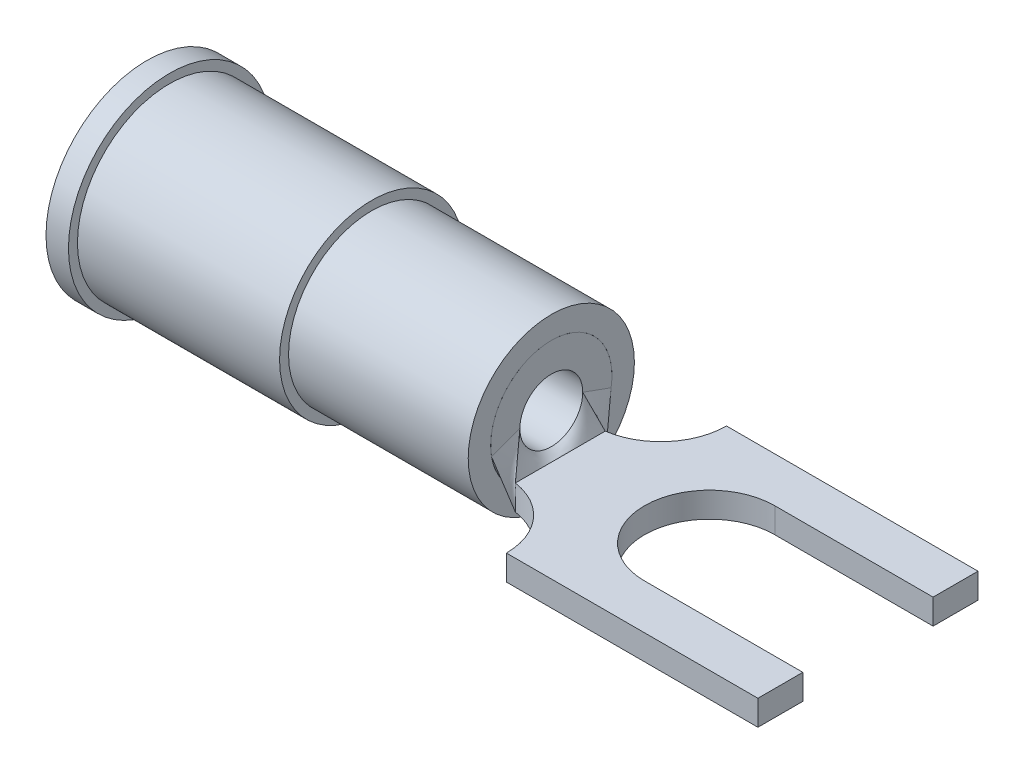
ISO-10303-21;
HEADER;
FILE_DESCRIPTION(('STEP AP214'),'2;1');
FILE_NAME('part.step','',(''),(''),'','','');
FILE_SCHEMA(('AUTOMOTIVE_DESIGN { 1 0 10303 214 1 1 1 1 }'));
ENDSEC;
DATA;
#1=APPLICATION_CONTEXT('core data for automotive mechanical design processes');
#2=APPLICATION_PROTOCOL_DEFINITION('international standard','automotive_design',2000,#1);
#3=PRODUCT_CONTEXT('',#1,'mechanical');
#4=PRODUCT('Part','Part','',(#3));
#5=PRODUCT_RELATED_PRODUCT_CATEGORY('part','',(#4));
#6=PRODUCT_DEFINITION_FORMATION('','',#4);
#7=PRODUCT_DEFINITION_CONTEXT('part definition',#1,'design');
#8=PRODUCT_DEFINITION('design','',#6,#7);
#9=PRODUCT_DEFINITION_SHAPE('','',#8);
#10=(LENGTH_UNIT() NAMED_UNIT(*) SI_UNIT(.MILLI.,.METRE.));
#11=(NAMED_UNIT(*) PLANE_ANGLE_UNIT() SI_UNIT($,.RADIAN.));
#12=(NAMED_UNIT(*) SI_UNIT($,.STERADIAN.) SOLID_ANGLE_UNIT());
#13=UNCERTAINTY_MEASURE_WITH_UNIT(LENGTH_MEASURE(1.E-05),#10,'distance_accuracy_value','');
#14=(GEOMETRIC_REPRESENTATION_CONTEXT(3) GLOBAL_UNCERTAINTY_ASSIGNED_CONTEXT((#13)) GLOBAL_UNIT_ASSIGNED_CONTEXT((#10,
#11,#12)) REPRESENTATION_CONTEXT('',''));
#15=CARTESIAN_POINT('',(0.,0.,0.));
#16=DIRECTION('',(0.,0.,1.));
#17=DIRECTION('',(1.,0.,0.));
#18=AXIS2_PLACEMENT_3D('',#15,#16,#17);
#19=CARTESIAN_POINT('',(11.684,-1.7272,-1.27));
#20=DIRECTION('',(-1.,0.,0.));
#21=DIRECTION('',(0.,0.,1.));
#22=AXIS2_PLACEMENT_3D('',#19,#20,#21);
#23=PLANE('',#22);
#24=DIRECTION('',(0.,0.,1.));
#25=VECTOR('',#24,1.);
#26=CARTESIAN_POINT('',(11.684,-1.016,-1.27));
#27=LINE('',#26,#25);
#28=CARTESIAN_POINT('',(11.684,-1.016,-1.27));
#29=VERTEX_POINT('',#28);
#30=CARTESIAN_POINT('',(11.684,-1.016,1.27));
#31=VERTEX_POINT('',#30);
#32=EDGE_CURVE('E191',#29,#31,#27,.T.);
#33=ORIENTED_EDGE('',*,*,#32,.T.);
#34=DIRECTION('',(0.,1.,0.));
#35=VECTOR('',#34,1.);
#36=CARTESIAN_POINT('',(11.684,-1.7272,1.27));
#37=LINE('',#36,#35);
#38=CARTESIAN_POINT('',(11.684,-1.7272,1.27));
#39=VERTEX_POINT('',#38);
#40=EDGE_CURVE('E100',#39,#31,#37,.T.);
#41=ORIENTED_EDGE('',*,*,#40,.F.);
#42=DIRECTION('',(0.,0.,1.));
#43=VECTOR('',#42,1.);
#44=CARTESIAN_POINT('',(11.684,-1.7272,-1.27));
#45=LINE('',#44,#43);
#46=CARTESIAN_POINT('',(11.684,-1.7272,-1.27));
#47=VERTEX_POINT('',#46);
#48=EDGE_CURVE('E293',#47,#39,#45,.T.);
#49=ORIENTED_EDGE('',*,*,#48,.F.);
#50=DIRECTION('',(0.,1.,0.));
#51=VECTOR('',#50,1.);
#52=CARTESIAN_POINT('',(11.684,-1.7272,-1.27));
#53=LINE('',#52,#51);
#54=EDGE_CURVE('E139',#47,#29,#53,.T.);
#55=ORIENTED_EDGE('',*,*,#54,.T.);
#56=EDGE_LOOP('',(#33,#41,#49,#55));
#57=FACE_BOUND('',#56,.T.);
#58=ADVANCED_FACE('F65',(#57),#23,.F.);
#59=CARTESIAN_POINT('',(11.43,0.,0.));
#60=DIRECTION('',(1.,0.,0.));
#61=DIRECTION('',(0.,0.,-1.));
#62=AXIS2_PLACEMENT_3D('',#59,#60,#61);
#63=PLANE('',#62);
#64=DIRECTION('',(0.,0.34202014332567,-0.939692620785908));
#65=VECTOR('',#64,1.);
#66=CARTESIAN_POINT('',(11.43,0.285719092505667,0.103993245033615));
#67=LINE('',#66,#65);
#68=CARTESIAN_POINT('',(11.43,-0.291379498495464,1.6895585926083));
#69=VERTEX_POINT('',#68);
#70=CARTESIAN_POINT('',(11.43,0.,0.889));
#71=VERTEX_POINT('',#70);
#72=EDGE_CURVE('E133',#69,#71,#67,.T.);
#73=ORIENTED_EDGE('',*,*,#72,.T.);
#74=CARTESIAN_POINT('',(11.43,0.,0.));
#75=DIRECTION('',(1.,0.,0.));
#76=DIRECTION('',(0.,0.,-1.));
#77=AXIS2_PLACEMENT_3D('',#74,#75,#76);
#78=CIRCLE('',#77,0.889);
#79=CARTESIAN_POINT('',(11.43,0.,-0.889));
#80=VERTEX_POINT('',#79);
#81=EDGE_CURVE('E13',#71,#80,#78,.T.);
#82=ORIENTED_EDGE('',*,*,#81,.T.);
#83=DIRECTION('',(0.,-0.34202014332567,-0.939692620785908));
#84=VECTOR('',#83,1.);
#85=CARTESIAN_POINT('',(11.43,0.285719092505667,-0.103993245033615));
#86=LINE('',#85,#84);
#87=CARTESIAN_POINT('',(11.43,-0.291379498495464,-1.6895585926083));
#88=VERTEX_POINT('',#87);
#89=EDGE_CURVE('E76',#80,#88,#86,.T.);
#90=ORIENTED_EDGE('',*,*,#89,.T.);
#91=CARTESIAN_POINT('',(11.43,0.,0.));
#92=DIRECTION('',(1.,0.,0.));
#93=DIRECTION('',(0.,0.,-1.));
#94=AXIS2_PLACEMENT_3D('',#91,#92,#93);
#95=CIRCLE('',#94,1.7145);
#96=EDGE_CURVE('E112',#69,#88,#95,.T.);
#97=ORIENTED_EDGE('',*,*,#96,.F.);
#98=EDGE_LOOP('',(#73,#82,#90,#97));
#99=FACE_BOUND('',#98,.T.);
#100=ADVANCED_FACE('F116',(#99),#63,.F.);
#101=CARTESIAN_POINT('',(11.43,-0.291379498495464,1.6895585926083));
#102=CARTESIAN_POINT('',(11.684,-1.7272,1.27));
#103=CARTESIAN_POINT('',(11.43,-0.430127833182765,1.6656302006868));
#104=CARTESIAN_POINT('',(11.684,-1.7272,1.16416666666667));
#105=CARTESIAN_POINT('',(11.43,-0.581040716903704,1.62218906384854));
#106=CARTESIAN_POINT('',(11.684,-1.7272,1.05833333333333));
#107=CARTESIAN_POINT('',(11.43,-0.891753825247846,1.4744086233896));
#108=CARTESIAN_POINT('',(11.684,-1.7272,0.846666666666665));
#109=CARTESIAN_POINT('',(11.43,-1.05167604388082,1.36940823154506));
#110=CARTESIAN_POINT('',(11.684,-1.7272,0.740833333333331));
#111=CARTESIAN_POINT('',(11.43,-1.3441775724631,1.08373800320161));
#112=CARTESIAN_POINT('',(11.684,-1.7272,0.529166666666664));
#113=CARTESIAN_POINT('',(11.43,-1.47596562928428,0.902303444981081));
#114=CARTESIAN_POINT('',(11.684,-1.7272,0.42333333333333));
#115=CARTESIAN_POINT('',(11.43,-1.66184767881455,0.48050841623427));
#116=CARTESIAN_POINT('',(11.684,-1.7272,0.211666666666663));
#117=CARTESIAN_POINT('',(11.43,-1.7145,0.240688121195688));
#118=CARTESIAN_POINT('',(11.684,-1.7272,0.10583333333333));
#119=CARTESIAN_POINT('',(11.43,-1.7145,-0.240688121195687));
#120=CARTESIAN_POINT('',(11.684,-1.7272,-0.105833333333337));
#121=CARTESIAN_POINT('',(11.43,-1.66184767881455,-0.480508416234269));
#122=CARTESIAN_POINT('',(11.684,-1.7272,-0.21166666666667));
#123=CARTESIAN_POINT('',(11.43,-1.47596562928428,-0.90230344498108));
#124=CARTESIAN_POINT('',(11.684,-1.7272,-0.423333333333336));
#125=CARTESIAN_POINT('',(11.43,-1.3441775724631,-1.08373800320161));
#126=CARTESIAN_POINT('',(11.684,-1.7272,-0.52916666666667));
#127=CARTESIAN_POINT('',(11.43,-1.05167604388082,-1.36940823154506));
#128=CARTESIAN_POINT('',(11.684,-1.7272,-0.740833333333336));
#129=CARTESIAN_POINT('',(11.43,-0.891753825247847,-1.4744086233896));
#130=CARTESIAN_POINT('',(11.684,-1.7272,-0.846666666666669));
#131=CARTESIAN_POINT('',(11.43,-0.581040716903704,-1.62218906384854));
#132=CARTESIAN_POINT('',(11.684,-1.7272,-1.05833333333333));
#133=CARTESIAN_POINT('',(11.43,-0.430127833182766,-1.6656302006868));
#134=CARTESIAN_POINT('',(11.684,-1.7272,-1.16416666666667));
#135=CARTESIAN_POINT('',(11.43,-0.291379498495464,-1.6895585926083));
#136=CARTESIAN_POINT('',(11.684,-1.7272,-1.27));
#137=B_SPLINE_SURFACE_WITH_KNOTS('',3,1,((#101,#102),(#103,#104),(#105,#106),(#107,#108),(#109,
#110),(#111,#112),(#113,#114),(#115,#116),(#117,#118),(#119,#120),(#121,#122),(#123,#124),(#125,
#126),(#127,#128),(#129,#130),(#131,#132),(#133,#134),(#135,#136)),.UNSPECIFIED.,.F.,.F.,.F.,(4,
2,2,2,2,2,2,2,4),(2,2),(0.,0.125,0.25,0.375,0.5,0.625,0.75,0.875,1.),(0.,1.),.UNSPECIFIED.);
#138=DIRECTION('',(0.167405290477298,-0.946314756407977,0.276520976645033));
#139=VECTOR('',#138,1.);
#140=CARTESIAN_POINT('',(11.557,-1.00928974924773,-1.47977929630415));
#141=LINE('',#140,#139);
#142=EDGE_CURVE('E130',#88,#47,#141,.T.);
#143=DIRECTION('',(-0.167405290477298,0.946314756407977,0.276520976645033));
#144=VECTOR('',#143,1.);
#145=CARTESIAN_POINT('',(11.557,-1.00928974924773,1.47977929630415));
#146=LINE('',#145,#144);
#147=EDGE_CURVE('E132',#39,#69,#146,.T.);
#148=ORIENTED_EDGE('',*,*,#96,.T.);
#149=ORIENTED_EDGE('',*,*,#142,.T.);
#150=ORIENTED_EDGE('',*,*,#48,.T.);
#151=ORIENTED_EDGE('',*,*,#147,.T.);
#152=EDGE_LOOP('',(#148,#149,#150,#151));
#153=FACE_BOUND('',#152,.T.);
#154=ADVANCED_FACE('F129',(#153),#137,.T.);
#155=CARTESIAN_POINT('',(11.43,-0.291379498495464,-1.6895585926083));
#156=CARTESIAN_POINT('',(11.684,-1.7272,-1.27));
#157=CARTESIAN_POINT('',(11.43,-0.242816248746221,-1.55613216050692));
#158=CARTESIAN_POINT('',(11.684,-1.60866666666666,-1.27));
#159=CARTESIAN_POINT('',(11.43,-0.194252998996977,-1.42270572840553));
#160=CARTESIAN_POINT('',(11.684,-1.49013333333333,-1.27));
#161=CARTESIAN_POINT('',(11.43,-0.0971264994984887,-1.15585286420277));
#162=CARTESIAN_POINT('',(11.684,-1.25306666666666,-1.27));
#163=CARTESIAN_POINT('',(11.43,-0.0485632497492445,-1.02242643210138));
#164=CARTESIAN_POINT('',(11.684,-1.13453333333333,-1.27));
#165=CARTESIAN_POINT('',(11.43,0.,-0.889));
#166=CARTESIAN_POINT('',(11.684,-1.016,-1.27));
#167=B_SPLINE_SURFACE_WITH_KNOTS('',3,1,((#155,#156),(#157,#158),(#159,#160),(#161,#162),(#163,
#164),(#165,#166)),.UNSPECIFIED.,.F.,.F.,.F.,(4,2,4),(2,2),(0.,0.5,1.),(0.,1.),.UNSPECIFIED.);
#168=DIRECTION('',(0.227921152919277,-0.911684611677103,-0.341881729378914));
#169=VECTOR('',#168,1.);
#170=CARTESIAN_POINT('',(11.557,-0.508,-1.0795));
#171=LINE('',#170,#169);
#172=EDGE_CURVE('E143',#80,#29,#171,.T.);
#173=ORIENTED_EDGE('',*,*,#89,.F.);
#174=ORIENTED_EDGE('',*,*,#172,.T.);
#175=ORIENTED_EDGE('',*,*,#54,.F.);
#176=ORIENTED_EDGE('',*,*,#142,.F.);
#177=EDGE_LOOP('',(#173,#174,#175,#176));
#178=FACE_BOUND('',#177,.T.);
#179=ADVANCED_FACE('F138',(#178),#167,.T.);
#180=CARTESIAN_POINT('',(11.43,0.,0.889));
#181=CARTESIAN_POINT('',(11.684,-1.016,1.27));
#182=CARTESIAN_POINT('',(11.43,-0.0485632497492443,1.02242643210138));
#183=CARTESIAN_POINT('',(11.684,-1.13453333333333,1.27));
#184=CARTESIAN_POINT('',(11.43,-0.0971264994984883,1.15585286420277));
#185=CARTESIAN_POINT('',(11.684,-1.25306666666667,1.27));
#186=CARTESIAN_POINT('',(11.43,-0.194252998996976,1.42270572840553));
#187=CARTESIAN_POINT('',(11.684,-1.49013333333333,1.27));
#188=CARTESIAN_POINT('',(11.43,-0.24281624874622,1.55613216050692));
#189=CARTESIAN_POINT('',(11.684,-1.60866666666667,1.27));
#190=CARTESIAN_POINT('',(11.43,-0.291379498495464,1.6895585926083));
#191=CARTESIAN_POINT('',(11.684,-1.7272,1.27));
#192=B_SPLINE_SURFACE_WITH_KNOTS('',3,1,((#180,#181),(#182,#183),(#184,#185),(#186,#187),(#188,
#189),(#190,#191)),.UNSPECIFIED.,.F.,.F.,.F.,(4,2,4),(2,2),(0.,0.5,1.),(0.,1.),.UNSPECIFIED.);
#193=DIRECTION('',(0.227921152919277,-0.911684611677103,0.341881729378914));
#194=VECTOR('',#193,1.);
#195=CARTESIAN_POINT('',(11.557,-0.508,1.0795));
#196=LINE('',#195,#194);
#197=EDGE_CURVE('E85',#71,#31,#196,.T.);
#198=ORIENTED_EDGE('',*,*,#72,.F.);
#199=ORIENTED_EDGE('',*,*,#147,.F.);
#200=ORIENTED_EDGE('',*,*,#40,.T.);
#201=ORIENTED_EDGE('',*,*,#197,.F.);
#202=EDGE_LOOP('',(#198,#199,#200,#201));
#203=FACE_BOUND('',#202,.T.);
#204=ADVANCED_FACE('F166',(#203),#192,.T.);
#205=CARTESIAN_POINT('',(11.43,0.,-0.889));
#206=CARTESIAN_POINT('',(11.684,-1.016,-1.27));
#207=CARTESIAN_POINT('',(11.43,-0.0740833333333333,-0.889));
#208=CARTESIAN_POINT('',(11.684,-1.016,-1.16416666666667));
#209=CARTESIAN_POINT('',(11.43,-0.1578864,-0.879991466666667));
#210=CARTESIAN_POINT('',(11.684,-1.016,-1.05833333333333));
#211=CARTESIAN_POINT('',(11.43,-0.3399536,-0.826888533333334));
#212=CARTESIAN_POINT('',(11.684,-1.016,-0.846666666666666));
#213=CARTESIAN_POINT('',(11.43,-0.438573333333333,-0.78232));
#214=CARTESIAN_POINT('',(11.684,-1.016,-0.740833333333333));
#215=CARTESIAN_POINT('',(11.43,-0.628226666666667,-0.64008));
#216=CARTESIAN_POINT('',(11.684,-1.016,-0.529166666666666));
#217=CARTESIAN_POINT('',(11.43,-0.718787773933103,-0.541397923875433));
#218=CARTESIAN_POINT('',(11.684,-1.016,-0.423333333333333));
#219=CARTESIAN_POINT('',(11.43,-0.850035755478662,-0.295307958477509));
#220=CARTESIAN_POINT('',(11.684,-1.016,-0.211666666666666));
#221=CARTESIAN_POINT('',(11.43,-0.889,-0.148166666666667));
#222=CARTESIAN_POINT('',(11.684,-1.016,-0.105833333333333));
#223=CARTESIAN_POINT('',(11.43,-0.889,0.148166666666667));
#224=CARTESIAN_POINT('',(11.684,-1.016,0.105833333333334));
#225=CARTESIAN_POINT('',(11.43,-0.850035755478662,0.295307958477509));
#226=CARTESIAN_POINT('',(11.684,-1.016,0.211666666666668));
#227=CARTESIAN_POINT('',(11.43,-0.718787773933103,0.541397923875433));
#228=CARTESIAN_POINT('',(11.684,-1.016,0.423333333333334));
#229=CARTESIAN_POINT('',(11.43,-0.628226666666667,0.64008));
#230=CARTESIAN_POINT('',(11.684,-1.016,0.529166666666667));
#231=CARTESIAN_POINT('',(11.43,-0.438573333333333,0.78232));
#232=CARTESIAN_POINT('',(11.684,-1.016,0.740833333333334));
#233=CARTESIAN_POINT('',(11.43,-0.3399536,0.826888533333334));
#234=CARTESIAN_POINT('',(11.684,-1.016,0.846666666666667));
#235=CARTESIAN_POINT('',(11.43,-0.1578864,0.879991466666667));
#236=CARTESIAN_POINT('',(11.684,-1.016,1.05833333333333));
#237=CARTESIAN_POINT('',(11.43,-0.0740833333333332,0.889));
#238=CARTESIAN_POINT('',(11.684,-1.016,1.16416666666667));
#239=CARTESIAN_POINT('',(11.43,0.,0.889));
#240=CARTESIAN_POINT('',(11.684,-1.016,1.27));
#241=B_SPLINE_SURFACE_WITH_KNOTS('',3,1,((#205,#206),(#207,#208),(#209,#210),(#211,#212),(#213,
#214),(#215,#216),(#217,#218),(#219,#220),(#221,#222),(#223,#224),(#225,#226),(#227,#228),(#229,
#230),(#231,#232),(#233,#234),(#235,#236),(#237,#238),(#239,#240)),.UNSPECIFIED.,.F.,.F.,.F.,(4,
2,2,2,2,2,2,2,4),(2,2),(0.,0.125,0.25,0.375,0.5,0.625,0.75,0.875,1.),(0.,1.),.UNSPECIFIED.);
#242=ORIENTED_EDGE('',*,*,#81,.F.);
#243=ORIENTED_EDGE('',*,*,#197,.T.);
#244=ORIENTED_EDGE('',*,*,#32,.F.);
#245=ORIENTED_EDGE('',*,*,#172,.F.);
#246=EDGE_LOOP('',(#242,#243,#244,#245));
#247=FACE_BOUND('',#246,.T.);
#248=ADVANCED_FACE('F196',(#247),#241,.T.);
#249=CLOSED_SHELL('',(#58,#100,#154,#179,#204,#248));
#250=MANIFOLD_SOLID_BREP('B2',#249);
#251=CARTESIAN_POINT('',(11.43,0.,0.));
#252=DIRECTION('',(1.,0.,0.));
#253=DIRECTION('',(0.,0.,-1.));
#254=AXIS2_PLACEMENT_3D('',#251,#252,#253);
#255=PLANE('',#254);
#256=CARTESIAN_POINT('',(11.43,0.,0.));
#257=DIRECTION('',(1.,0.,0.));
#258=DIRECTION('',(0.,0.,-1.));
#259=AXIS2_PLACEMENT_3D('',#256,#257,#258);
#260=CIRCLE('',#259,1.7145);
#261=CARTESIAN_POINT('',(11.43,-0.291379498495464,-1.6895585926083));
#262=VERTEX_POINT('',#261);
#263=CARTESIAN_POINT('',(11.43,-0.291379498495464,1.6895585926083));
#264=VERTEX_POINT('',#263);
#265=EDGE_CURVE('E447',#262,#264,#260,.T.);
#266=ORIENTED_EDGE('',*,*,#265,.T.);
#267=DIRECTION('',(0.,0.34202014332567,-0.939692620785908));
#268=VECTOR('',#267,1.);
#269=CARTESIAN_POINT('',(11.43,0.285719092505667,0.103993245033615));
#270=LINE('',#269,#268);
#271=CARTESIAN_POINT('',(11.43,0.,0.889));
#272=VERTEX_POINT('',#271);
#273=EDGE_CURVE('E63',#264,#272,#270,.T.);
#274=ORIENTED_EDGE('',*,*,#273,.T.);
#275=CARTESIAN_POINT('',(11.43,0.,0.));
#276=DIRECTION('',(1.,0.,0.));
#277=DIRECTION('',(0.,0.,-1.));
#278=AXIS2_PLACEMENT_3D('',#275,#276,#277);
#279=CIRCLE('',#278,0.889);
#280=CARTESIAN_POINT('',(11.43,0.,-0.889));
#281=VERTEX_POINT('',#280);
#282=EDGE_CURVE('E445',#281,#272,#279,.T.);
#283=ORIENTED_EDGE('',*,*,#282,.F.);
#284=DIRECTION('',(0.,-0.34202014332567,-0.939692620785908));
#285=VECTOR('',#284,1.);
#286=CARTESIAN_POINT('',(11.43,0.285719092505667,-0.103993245033615));
#287=LINE('',#286,#285);
#288=EDGE_CURVE('E419',#281,#262,#287,.T.);
#289=ORIENTED_EDGE('',*,*,#288,.T.);
#290=EDGE_LOOP('',(#266,#274,#283,#289));
#291=FACE_BOUND('',#290,.T.);
#292=ADVANCED_FACE('F410',(#291),#255,.T.);
#293=CARTESIAN_POINT('',(-4.84933830537734,0.,0.));
#294=DIRECTION('',(1.,0.,0.));
#295=DIRECTION('',(0.,0.,-1.));
#296=AXIS2_PLACEMENT_3D('',#293,#294,#295);
#297=CYLINDRICAL_SURFACE('',#296,1.7145);
#298=CARTESIAN_POINT('',(6.35,0.,0.));
#299=DIRECTION('',(1.,0.,0.));
#300=DIRECTION('',(0.,0.,-1.));
#301=AXIS2_PLACEMENT_3D('',#298,#299,#300);
#302=CIRCLE('',#301,1.7145);
#303=CARTESIAN_POINT('',(6.35,0.,-1.7145));
#304=VERTEX_POINT('',#303);
#305=EDGE_CURVE('E442',#304,#304,#302,.F.);
#306=ORIENTED_EDGE('',*,*,#305,.F.);
#307=EDGE_LOOP('',(#306));
#308=FACE_BOUND('',#307,.T.);
#309=EDGE_CURVE('E440',#264,#262,#260,.T.);
#310=ORIENTED_EDGE('',*,*,#309,.F.);
#311=ORIENTED_EDGE('',*,*,#265,.F.);
#312=EDGE_LOOP('',(#310,#311));
#313=FACE_BOUND('',#312,.T.);
#314=ADVANCED_FACE('F412',(#308,#313),#297,.T.);
#315=ORIENTED_EDGE('',*,*,#273,.F.);
#316=ORIENTED_EDGE('',*,*,#309,.T.);
#317=ORIENTED_EDGE('',*,*,#288,.F.);
#318=EDGE_CURVE('E437',#272,#281,#279,.T.);
#319=ORIENTED_EDGE('',*,*,#318,.F.);
#320=EDGE_LOOP('',(#315,#316,#317,#319));
#321=FACE_BOUND('',#320,.T.);
#322=ADVANCED_FACE('F436',(#321),#255,.T.);
#323=CARTESIAN_POINT('',(-4.84933830537734,0.,0.));
#324=DIRECTION('',(1.,0.,0.));
#325=DIRECTION('',(0.,0.,-1.));
#326=AXIS2_PLACEMENT_3D('',#323,#324,#325);
#327=CYLINDRICAL_SURFACE('',#326,0.889);
#328=CARTESIAN_POINT('',(6.35,0.,0.));
#329=DIRECTION('',(1.,0.,0.));
#330=DIRECTION('',(0.,0.,-1.));
#331=AXIS2_PLACEMENT_3D('',#328,#329,#330);
#332=CIRCLE('',#331,0.889);
#333=CARTESIAN_POINT('',(6.35,0.,-0.889));
#334=VERTEX_POINT('',#333);
#335=EDGE_CURVE('E451',#334,#334,#332,.F.);
#336=ORIENTED_EDGE('',*,*,#335,.T.);
#337=EDGE_LOOP('',(#336));
#338=FACE_BOUND('',#337,.T.);
#339=ORIENTED_EDGE('',*,*,#282,.T.);
#340=ORIENTED_EDGE('',*,*,#318,.T.);
#341=EDGE_LOOP('',(#339,#340));
#342=FACE_BOUND('',#341,.T.);
#343=ADVANCED_FACE('F444',(#338,#342),#327,.F.);
#344=CARTESIAN_POINT('',(6.35,2.8575,0.));
#345=DIRECTION('',(1.,0.,0.));
#346=DIRECTION('',(0.,0.,-1.));
#347=AXIS2_PLACEMENT_3D('',#344,#345,#346);
#348=PLANE('',#347);
#349=ORIENTED_EDGE('',*,*,#305,.T.);
#350=EDGE_LOOP('',(#349));
#351=FACE_BOUND('',#350,.T.);
#352=ORIENTED_EDGE('',*,*,#335,.F.);
#353=EDGE_LOOP('',(#352));
#354=FACE_BOUND('',#353,.T.);
#355=ADVANCED_FACE('F458',(#351,#354),#348,.F.);
#356=CLOSED_SHELL('',(#292,#314,#322,#343,#355));
#357=MANIFOLD_SOLID_BREP('B7',#356);
#358=CARTESIAN_POINT('',(11.40968,-1.7272,-3.1115));
#359=DIRECTION('',(0.,1.,0.));
#360=DIRECTION('',(0.,0.,1.));
#361=AXIS2_PLACEMENT_3D('',#358,#359,#360);
#362=CYLINDRICAL_SURFACE('',#361,1.86182);
#363=CARTESIAN_POINT('',(11.40968,-1.016,-3.1115));
#364=DIRECTION('',(0.,-1.,0.));
#365=DIRECTION('',(0.,0.,-1.));
#366=AXIS2_PLACEMENT_3D('',#363,#364,#365);
#367=CIRCLE('',#366,1.86182);
#368=CARTESIAN_POINT('',(13.2715,-1.016,-3.1115));
#369=VERTEX_POINT('',#368);
#370=CARTESIAN_POINT('',(11.684,-1.016,-1.27));
#371=VERTEX_POINT('',#370);
#372=EDGE_CURVE('E628',#369,#371,#367,.T.);
#373=ORIENTED_EDGE('',*,*,#372,.F.);
#374=DIRECTION('',(0.,1.,0.));
#375=VECTOR('',#374,1.);
#376=CARTESIAN_POINT('',(13.2715,-1.7272,-3.1115));
#377=LINE('',#376,#375);
#378=CARTESIAN_POINT('',(13.2715,-1.7272,-3.1115));
#379=VERTEX_POINT('',#378);
#380=EDGE_CURVE('E408',#379,#369,#377,.T.);
#381=ORIENTED_EDGE('',*,*,#380,.F.);
#382=CARTESIAN_POINT('',(11.40968,-1.7272,-3.1115));
#383=DIRECTION('',(0.,-1.,0.));
#384=DIRECTION('',(0.,0.,-1.));
#385=AXIS2_PLACEMENT_3D('',#382,#383,#384);
#386=CIRCLE('',#385,1.86182);
#387=CARTESIAN_POINT('',(11.684,-1.7272,-1.27));
#388=VERTEX_POINT('',#387);
#389=EDGE_CURVE('E654',#379,#388,#386,.T.);
#390=ORIENTED_EDGE('',*,*,#389,.T.);
#391=DIRECTION('',(0.,1.,0.));
#392=VECTOR('',#391,1.);
#393=CARTESIAN_POINT('',(11.684,-1.7272,-1.27));
#394=LINE('',#393,#392);
#395=EDGE_CURVE('E522',#388,#371,#394,.T.);
#396=ORIENTED_EDGE('',*,*,#395,.T.);
#397=EDGE_LOOP('',(#373,#381,#390,#396));
#398=FACE_BOUND('',#397,.T.);
#399=ADVANCED_FACE('F519',(#398),#362,.F.);
#400=CARTESIAN_POINT('',(13.2715,-1.7272,-3.1115));
#401=DIRECTION('',(0.,0.,-1.));
#402=DIRECTION('',(-1.,0.,0.));
#403=AXIS2_PLACEMENT_3D('',#400,#401,#402);
#404=PLANE('',#403);
#405=DIRECTION('',(-1.,0.,0.));
#406=VECTOR('',#405,1.);
#407=CARTESIAN_POINT('',(13.2715,-1.016,-3.1115));
#408=LINE('',#407,#406);
#409=CARTESIAN_POINT('',(20.3835,-1.016,-3.1115));
#410=VERTEX_POINT('',#409);
#411=EDGE_CURVE('E652',#410,#369,#408,.T.);
#412=ORIENTED_EDGE('',*,*,#411,.F.);
#413=DIRECTION('',(0.,1.,0.));
#414=VECTOR('',#413,1.);
#415=CARTESIAN_POINT('',(20.3835,-1.7272,-3.1115));
#416=LINE('',#415,#414);
#417=CARTESIAN_POINT('',(20.3835,-1.7272,-3.1115));
#418=VERTEX_POINT('',#417);
#419=EDGE_CURVE('E528',#418,#410,#416,.T.);
#420=ORIENTED_EDGE('',*,*,#419,.F.);
#421=DIRECTION('',(-1.,0.,0.));
#422=VECTOR('',#421,1.);
#423=CARTESIAN_POINT('',(13.2715,-1.7272,-3.1115));
#424=LINE('',#423,#422);
#425=EDGE_CURVE('E618',#418,#379,#424,.T.);
#426=ORIENTED_EDGE('',*,*,#425,.T.);
#427=ORIENTED_EDGE('',*,*,#380,.T.);
#428=EDGE_LOOP('',(#412,#420,#426,#427));
#429=FACE_BOUND('',#428,.T.);
#430=ADVANCED_FACE('F670',(#429),#404,.T.);
#431=CARTESIAN_POINT('',(20.3835,-1.7272,-3.1115));
#432=DIRECTION('',(1.,0.,0.));
#433=DIRECTION('',(0.,0.,-1.));
#434=AXIS2_PLACEMENT_3D('',#431,#432,#433);
#435=PLANE('',#434);
#436=DIRECTION('',(0.,0.,-1.));
#437=VECTOR('',#436,1.);
#438=CARTESIAN_POINT('',(20.3835,-1.016,-3.1115));
#439=LINE('',#438,#437);
#440=CARTESIAN_POINT('',(20.3835,-1.016,-1.8415));
#441=VERTEX_POINT('',#440);
#442=EDGE_CURVE('E605',#441,#410,#439,.T.);
#443=ORIENTED_EDGE('',*,*,#442,.F.);
#444=DIRECTION('',(0.,1.,0.));
#445=VECTOR('',#444,1.);
#446=CARTESIAN_POINT('',(20.3835,-1.7272,-1.8415));
#447=LINE('',#446,#445);
#448=CARTESIAN_POINT('',(20.3835,-1.7272,-1.8415));
#449=VERTEX_POINT('',#448);
#450=EDGE_CURVE('E600',#449,#441,#447,.T.);
#451=ORIENTED_EDGE('',*,*,#450,.F.);
#452=DIRECTION('',(0.,0.,-1.));
#453=VECTOR('',#452,1.);
#454=CARTESIAN_POINT('',(20.3835,-1.7272,-3.1115));
#455=LINE('',#454,#453);
#456=EDGE_CURVE('E603',#449,#418,#455,.T.);
#457=ORIENTED_EDGE('',*,*,#456,.T.);
#458=ORIENTED_EDGE('',*,*,#419,.T.);
#459=EDGE_LOOP('',(#443,#451,#457,#458));
#460=FACE_BOUND('',#459,.T.);
#461=ADVANCED_FACE('F602',(#460),#435,.T.);
#462=CARTESIAN_POINT('',(20.3835,-1.7272,-1.8415));
#463=DIRECTION('',(0.,0.,1.));
#464=DIRECTION('',(1.,0.,0.));
#465=AXIS2_PLACEMENT_3D('',#462,#463,#464);
#466=PLANE('',#465);
#467=DIRECTION('',(1.,0.,0.));
#468=VECTOR('',#467,1.);
#469=CARTESIAN_POINT('',(20.3835,-1.016,-1.8415));
#470=LINE('',#469,#468);
#471=CARTESIAN_POINT('',(15.90675,-1.016,-1.8415));
#472=VERTEX_POINT('',#471);
#473=EDGE_CURVE('E649',#472,#441,#470,.T.);
#474=ORIENTED_EDGE('',*,*,#473,.F.);
#475=DIRECTION('',(0.,1.,0.));
#476=VECTOR('',#475,1.);
#477=CARTESIAN_POINT('',(15.90675,-1.7272,-1.8415));
#478=LINE('',#477,#476);
#479=CARTESIAN_POINT('',(15.90675,-1.7272,-1.8415));
#480=VERTEX_POINT('',#479);
#481=EDGE_CURVE('E610',#480,#472,#478,.T.);
#482=ORIENTED_EDGE('',*,*,#481,.F.);
#483=DIRECTION('',(1.,0.,0.));
#484=VECTOR('',#483,1.);
#485=CARTESIAN_POINT('',(20.3835,-1.7272,-1.8415));
#486=LINE('',#485,#484);
#487=EDGE_CURVE('E616',#480,#449,#486,.T.);
#488=ORIENTED_EDGE('',*,*,#487,.T.);
#489=ORIENTED_EDGE('',*,*,#450,.T.);
#490=EDGE_LOOP('',(#474,#482,#488,#489));
#491=FACE_BOUND('',#490,.T.);
#492=ADVANCED_FACE('F620',(#491),#466,.T.);
#493=CARTESIAN_POINT('',(15.90675,-1.7272,0.));
#494=DIRECTION('',(0.,1.,0.));
#495=DIRECTION('',(0.,0.,1.));
#496=AXIS2_PLACEMENT_3D('',#493,#494,#495);
#497=CYLINDRICAL_SURFACE('',#496,1.8415);
#498=CARTESIAN_POINT('',(15.90675,-1.016,0.));
#499=DIRECTION('',(0.,-1.,0.));
#500=DIRECTION('',(0.,0.,1.));
#501=AXIS2_PLACEMENT_3D('',#498,#499,#500);
#502=CIRCLE('',#501,1.8415);
#503=CARTESIAN_POINT('',(15.90675,-1.016,1.8415));
#504=VERTEX_POINT('',#503);
#505=EDGE_CURVE('E646',#504,#472,#502,.T.);
#506=ORIENTED_EDGE('',*,*,#505,.F.);
#507=DIRECTION('',(0.,1.,0.));
#508=VECTOR('',#507,1.);
#509=CARTESIAN_POINT('',(15.90675,-1.7272,1.8415));
#510=LINE('',#509,#508);
#511=CARTESIAN_POINT('',(15.90675,-1.7272,1.8415));
#512=VERTEX_POINT('',#511);
#513=EDGE_CURVE('E658',#512,#504,#510,.T.);
#514=ORIENTED_EDGE('',*,*,#513,.F.);
#515=CARTESIAN_POINT('',(15.90675,-1.7272,0.));
#516=DIRECTION('',(0.,-1.,0.));
#517=DIRECTION('',(0.,0.,1.));
#518=AXIS2_PLACEMENT_3D('',#515,#516,#517);
#519=CIRCLE('',#518,1.8415);
#520=EDGE_CURVE('E621',#512,#480,#519,.T.);
#521=ORIENTED_EDGE('',*,*,#520,.T.);
#522=ORIENTED_EDGE('',*,*,#481,.T.);
#523=EDGE_LOOP('',(#506,#514,#521,#522));
#524=FACE_BOUND('',#523,.T.);
#525=ADVANCED_FACE('F683',(#524),#497,.F.);
#526=CARTESIAN_POINT('',(20.3835,-1.7272,1.8415));
#527=DIRECTION('',(0.,0.,-1.));
#528=DIRECTION('',(-1.,0.,0.));
#529=AXIS2_PLACEMENT_3D('',#526,#527,#528);
#530=PLANE('',#529);
#531=DIRECTION('',(-1.,0.,0.));
#532=VECTOR('',#531,1.);
#533=CARTESIAN_POINT('',(20.3835,-1.016,1.8415));
#534=LINE('',#533,#532);
#535=CARTESIAN_POINT('',(20.3835,-1.016,1.8415));
#536=VERTEX_POINT('',#535);
#537=EDGE_CURVE('E643',#536,#504,#534,.T.);
#538=ORIENTED_EDGE('',*,*,#537,.F.);
#539=DIRECTION('',(0.,1.,0.));
#540=VECTOR('',#539,1.);
#541=CARTESIAN_POINT('',(20.3835,-1.7272,1.8415));
#542=LINE('',#541,#540);
#543=CARTESIAN_POINT('',(20.3835,-1.7272,1.8415));
#544=VERTEX_POINT('',#543);
#545=EDGE_CURVE('E660',#544,#536,#542,.T.);
#546=ORIENTED_EDGE('',*,*,#545,.F.);
#547=DIRECTION('',(-1.,0.,0.));
#548=VECTOR('',#547,1.);
#549=CARTESIAN_POINT('',(20.3835,-1.7272,1.8415));
#550=LINE('',#549,#548);
#551=EDGE_CURVE('E623',#544,#512,#550,.T.);
#552=ORIENTED_EDGE('',*,*,#551,.T.);
#553=ORIENTED_EDGE('',*,*,#513,.T.);
#554=EDGE_LOOP('',(#538,#546,#552,#553));
#555=FACE_BOUND('',#554,.T.);
#556=ADVANCED_FACE('F686',(#555),#530,.T.);
#557=CARTESIAN_POINT('',(20.3835,-1.7272,3.1115));
#558=DIRECTION('',(1.,0.,0.));
#559=DIRECTION('',(0.,0.,-1.));
#560=AXIS2_PLACEMENT_3D('',#557,#558,#559);
#561=PLANE('',#560);
#562=DIRECTION('',(0.,0.,-1.));
#563=VECTOR('',#562,1.);
#564=CARTESIAN_POINT('',(20.3835,-1.016,3.1115));
#565=LINE('',#564,#563);
#566=CARTESIAN_POINT('',(20.3835,-1.016,3.1115));
#567=VERTEX_POINT('',#566);
#568=EDGE_CURVE('E640',#567,#536,#565,.T.);
#569=ORIENTED_EDGE('',*,*,#568,.F.);
#570=DIRECTION('',(0.,1.,0.));
#571=VECTOR('',#570,1.);
#572=CARTESIAN_POINT('',(20.3835,-1.7272,3.1115));
#573=LINE('',#572,#571);
#574=CARTESIAN_POINT('',(20.3835,-1.7272,3.1115));
#575=VERTEX_POINT('',#574);
#576=EDGE_CURVE('E662',#575,#567,#573,.T.);
#577=ORIENTED_EDGE('',*,*,#576,.F.);
#578=DIRECTION('',(0.,0.,-1.));
#579=VECTOR('',#578,1.);
#580=CARTESIAN_POINT('',(20.3835,-1.7272,3.1115));
#581=LINE('',#580,#579);
#582=EDGE_CURVE('E785',#575,#544,#581,.T.);
#583=ORIENTED_EDGE('',*,*,#582,.T.);
#584=ORIENTED_EDGE('',*,*,#545,.T.);
#585=EDGE_LOOP('',(#569,#577,#583,#584));
#586=FACE_BOUND('',#585,.T.);
#587=ADVANCED_FACE('F690',(#586),#561,.T.);
#588=CARTESIAN_POINT('',(13.2715,-1.7272,3.1115));
#589=DIRECTION('',(0.,0.,1.));
#590=DIRECTION('',(1.,0.,0.));
#591=AXIS2_PLACEMENT_3D('',#588,#589,#590);
#592=PLANE('',#591);
#593=DIRECTION('',(1.,0.,0.));
#594=VECTOR('',#593,1.);
#595=CARTESIAN_POINT('',(13.2715,-1.016,3.1115));
#596=LINE('',#595,#594);
#597=CARTESIAN_POINT('',(13.2715,-1.016,3.1115));
#598=VERTEX_POINT('',#597);
#599=EDGE_CURVE('E637',#598,#567,#596,.T.);
#600=ORIENTED_EDGE('',*,*,#599,.F.);
#601=DIRECTION('',(0.,1.,0.));
#602=VECTOR('',#601,1.);
#603=CARTESIAN_POINT('',(13.2715,-1.7272,3.1115));
#604=LINE('',#603,#602);
#605=CARTESIAN_POINT('',(13.2715,-1.7272,3.1115));
#606=VERTEX_POINT('',#605);
#607=EDGE_CURVE('E664',#606,#598,#604,.T.);
#608=ORIENTED_EDGE('',*,*,#607,.F.);
#609=DIRECTION('',(1.,0.,0.));
#610=VECTOR('',#609,1.);
#611=CARTESIAN_POINT('',(13.2715,-1.7272,3.1115));
#612=LINE('',#611,#610);
#613=EDGE_CURVE('E781',#606,#575,#612,.T.);
#614=ORIENTED_EDGE('',*,*,#613,.T.);
#615=ORIENTED_EDGE('',*,*,#576,.T.);
#616=EDGE_LOOP('',(#600,#608,#614,#615));
#617=FACE_BOUND('',#616,.T.);
#618=ADVANCED_FACE('F694',(#617),#592,.T.);
#619=CARTESIAN_POINT('',(11.40968,-1.7272,3.1115));
#620=DIRECTION('',(0.,1.,0.));
#621=DIRECTION('',(0.,0.,1.));
#622=AXIS2_PLACEMENT_3D('',#619,#620,#621);
#623=CYLINDRICAL_SURFACE('',#622,1.86182);
#624=CARTESIAN_POINT('',(11.40968,-1.016,3.1115));
#625=DIRECTION('',(0.,-1.,0.));
#626=DIRECTION('',(0.,0.,1.));
#627=AXIS2_PLACEMENT_3D('',#624,#625,#626);
#628=CIRCLE('',#627,1.86182);
#629=CARTESIAN_POINT('',(11.684,-1.016,1.27));
#630=VERTEX_POINT('',#629);
#631=EDGE_CURVE('E634',#630,#598,#628,.T.);
#632=ORIENTED_EDGE('',*,*,#631,.F.);
#633=DIRECTION('',(0.,1.,0.));
#634=VECTOR('',#633,1.);
#635=CARTESIAN_POINT('',(11.684,-1.7272,1.27));
#636=LINE('',#635,#634);
#637=CARTESIAN_POINT('',(11.684,-1.7272,1.27));
#638=VERTEX_POINT('',#637);
#639=EDGE_CURVE('E665',#638,#630,#636,.T.);
#640=ORIENTED_EDGE('',*,*,#639,.F.);
#641=CARTESIAN_POINT('',(11.40968,-1.7272,3.1115));
#642=DIRECTION('',(0.,-1.,0.));
#643=DIRECTION('',(0.,0.,1.));
#644=AXIS2_PLACEMENT_3D('',#641,#642,#643);
#645=CIRCLE('',#644,1.86182);
#646=EDGE_CURVE('E792',#638,#606,#645,.T.);
#647=ORIENTED_EDGE('',*,*,#646,.T.);
#648=ORIENTED_EDGE('',*,*,#607,.T.);
#649=EDGE_LOOP('',(#632,#640,#647,#648));
#650=FACE_BOUND('',#649,.T.);
#651=ADVANCED_FACE('F698',(#650),#623,.F.);
#652=CARTESIAN_POINT('',(11.684,-1.7272,-1.27));
#653=DIRECTION('',(-1.,0.,0.));
#654=DIRECTION('',(0.,0.,1.));
#655=AXIS2_PLACEMENT_3D('',#652,#653,#654);
#656=PLANE('',#655);
#657=DIRECTION('',(0.,0.,1.));
#658=VECTOR('',#657,1.);
#659=CARTESIAN_POINT('',(11.684,-1.016,-1.27));
#660=LINE('',#659,#658);
#661=EDGE_CURVE('E631',#371,#630,#660,.T.);
#662=ORIENTED_EDGE('',*,*,#661,.F.);
#663=ORIENTED_EDGE('',*,*,#395,.F.);
#664=DIRECTION('',(0.,0.,1.));
#665=VECTOR('',#664,1.);
#666=CARTESIAN_POINT('',(11.684,-1.7272,-1.27));
#667=LINE('',#666,#665);
#668=EDGE_CURVE('E794',#388,#638,#667,.T.);
#669=ORIENTED_EDGE('',*,*,#668,.T.);
#670=ORIENTED_EDGE('',*,*,#639,.T.);
#671=EDGE_LOOP('',(#662,#663,#669,#670));
#672=FACE_BOUND('',#671,.T.);
#673=ADVANCED_FACE('F667',(#672),#656,.T.);
#674=CARTESIAN_POINT('',(11.40968,-1.7272,-3.1115));
#675=DIRECTION('',(0.,-1.,0.));
#676=DIRECTION('',(0.,0.,-1.));
#677=AXIS2_PLACEMENT_3D('',#674,#675,#676);
#678=PLANE('',#677);
#679=ORIENTED_EDGE('',*,*,#389,.F.);
#680=ORIENTED_EDGE('',*,*,#425,.F.);
#681=ORIENTED_EDGE('',*,*,#456,.F.);
#682=ORIENTED_EDGE('',*,*,#487,.F.);
#683=ORIENTED_EDGE('',*,*,#520,.F.);
#684=ORIENTED_EDGE('',*,*,#551,.F.);
#685=ORIENTED_EDGE('',*,*,#582,.F.);
#686=ORIENTED_EDGE('',*,*,#613,.F.);
#687=ORIENTED_EDGE('',*,*,#646,.F.);
#688=ORIENTED_EDGE('',*,*,#668,.F.);
#689=EDGE_LOOP('',(#679,#680,#681,#682,#683,#684,#685,#686,#687,#688));
#690=FACE_BOUND('',#689,.T.);
#691=ADVANCED_FACE('F614',(#690),#678,.T.);
#692=CARTESIAN_POINT('',(11.40968,-1.016,-3.1115));
#693=DIRECTION('',(0.,-1.,0.));
#694=DIRECTION('',(0.,0.,-1.));
#695=AXIS2_PLACEMENT_3D('',#692,#693,#694);
#696=PLANE('',#695);
#697=ORIENTED_EDGE('',*,*,#372,.T.);
#698=ORIENTED_EDGE('',*,*,#661,.T.);
#699=ORIENTED_EDGE('',*,*,#631,.T.);
#700=ORIENTED_EDGE('',*,*,#599,.T.);
#701=ORIENTED_EDGE('',*,*,#568,.T.);
#702=ORIENTED_EDGE('',*,*,#537,.T.);
#703=ORIENTED_EDGE('',*,*,#505,.T.);
#704=ORIENTED_EDGE('',*,*,#473,.T.);
#705=ORIENTED_EDGE('',*,*,#442,.T.);
#706=ORIENTED_EDGE('',*,*,#411,.T.);
#707=EDGE_LOOP('',(#697,#698,#699,#700,#701,#702,#703,#704,#705,#706));
#708=FACE_BOUND('',#707,.T.);
#709=ADVANCED_FACE('F669',(#708),#696,.F.);
#710=CLOSED_SHELL('',(#399,#430,#461,#492,#525,#556,#587,#618,#651,#673,#691,#709));
#711=MANIFOLD_SOLID_BREP('B57',#710);
#712=CARTESIAN_POINT('',(0.,2.8575,0.));
#713=DIRECTION('',(1.,0.,0.));
#714=DIRECTION('',(0.,0.,-1.));
#715=AXIS2_PLACEMENT_3D('',#712,#713,#714);
#716=PLANE('',#715);
#717=CARTESIAN_POINT('',(0.,0.,0.));
#718=DIRECTION('',(-1.,0.,0.));
#719=DIRECTION('',(0.,0.,1.));
#720=AXIS2_PLACEMENT_3D('',#717,#718,#719);
#721=CIRCLE('',#720,1.8923);
#722=CARTESIAN_POINT('',(0.,0.,1.8923));
#723=VERTEX_POINT('',#722);
#724=EDGE_CURVE('E518',#723,#723,#721,.T.);
#725=ORIENTED_EDGE('',*,*,#724,.F.);
#726=EDGE_LOOP('',(#725));
#727=FACE_BOUND('',#726,.T.);
#728=CARTESIAN_POINT('',(0.,0.,0.));
#729=DIRECTION('',(-1.,0.,0.));
#730=DIRECTION('',(0.,0.,1.));
#731=AXIS2_PLACEMENT_3D('',#728,#729,#730);
#732=CIRCLE('',#731,2.8575);
#733=CARTESIAN_POINT('',(0.,0.,2.8575));
#734=VERTEX_POINT('',#733);
#735=EDGE_CURVE('E836',#734,#734,#732,.T.);
#736=ORIENTED_EDGE('',*,*,#735,.T.);
#737=EDGE_LOOP('',(#736));
#738=FACE_BOUND('',#737,.T.);
#739=ADVANCED_FACE('F799',(#727,#738),#716,.F.);
#740=CARTESIAN_POINT('',(0.,0.,0.));
#741=DIRECTION('',(-1.,0.,0.));
#742=DIRECTION('',(0.,0.,1.));
#743=AXIS2_PLACEMENT_3D('',#740,#741,#742);
#744=CYLINDRICAL_SURFACE('',#743,1.8923);
#745=CARTESIAN_POINT('',(0.635,0.,0.));
#746=DIRECTION('',(-1.,0.,0.));
#747=DIRECTION('',(0.,0.,1.));
#748=AXIS2_PLACEMENT_3D('',#745,#746,#747);
#749=CIRCLE('',#748,1.8923);
#750=CARTESIAN_POINT('',(0.635,0.,1.8923));
#751=VERTEX_POINT('',#750);
#752=EDGE_CURVE('E805',#751,#751,#749,.T.);
#753=ORIENTED_EDGE('',*,*,#752,.F.);
#754=EDGE_LOOP('',(#753));
#755=FACE_BOUND('',#754,.T.);
#756=ORIENTED_EDGE('',*,*,#724,.T.);
#757=EDGE_LOOP('',(#756));
#758=FACE_BOUND('',#757,.T.);
#759=ADVANCED_FACE('F891',(#755,#758),#744,.F.);
#760=CARTESIAN_POINT('',(0.635,0.,0.));
#761=DIRECTION('',(-1.,0.,0.));
#762=DIRECTION('',(0.,0.,1.));
#763=AXIS2_PLACEMENT_3D('',#760,#761,#762);
#764=CONICAL_SURFACE('',#763,1.8923,0.189905864675548);
#765=CARTESIAN_POINT('',(6.35,0.,0.));
#766=DIRECTION('',(-1.,0.,0.));
#767=DIRECTION('',(0.,0.,1.));
#768=AXIS2_PLACEMENT_3D('',#765,#766,#767);
#769=CIRCLE('',#768,0.79375);
#770=CARTESIAN_POINT('',(6.35,0.,0.79375));
#771=VERTEX_POINT('',#770);
#772=EDGE_CURVE('E809',#771,#771,#769,.T.);
#773=ORIENTED_EDGE('',*,*,#772,.F.);
#774=EDGE_LOOP('',(#773));
#775=FACE_BOUND('',#774,.T.);
#776=ORIENTED_EDGE('',*,*,#752,.T.);
#777=EDGE_LOOP('',(#776));
#778=FACE_BOUND('',#777,.T.);
#779=ADVANCED_FACE('F886',(#775,#778),#764,.F.);
#780=CARTESIAN_POINT('',(6.35,0.79375,0.));
#781=DIRECTION('',(-1.,0.,0.));
#782=DIRECTION('',(0.,0.,1.));
#783=AXIS2_PLACEMENT_3D('',#780,#781,#782);
#784=PLANE('',#783);
#785=CARTESIAN_POINT('',(6.35,0.,0.));
#786=DIRECTION('',(-1.,0.,0.));
#787=DIRECTION('',(0.,0.,1.));
#788=AXIS2_PLACEMENT_3D('',#785,#786,#787);
#789=CIRCLE('',#788,1.7145);
#790=CARTESIAN_POINT('',(6.35,0.,1.7145));
#791=VERTEX_POINT('',#790);
#792=EDGE_CURVE('E813',#791,#791,#789,.T.);
#793=ORIENTED_EDGE('',*,*,#792,.F.);
#794=EDGE_LOOP('',(#793));
#795=FACE_BOUND('',#794,.T.);
#796=ORIENTED_EDGE('',*,*,#772,.T.);
#797=EDGE_LOOP('',(#796));
#798=FACE_BOUND('',#797,.T.);
#799=ADVANCED_FACE('F880',(#795,#798),#784,.F.);
#800=CARTESIAN_POINT('',(0.,0.,0.));
#801=DIRECTION('',(-1.,0.,0.));
#802=DIRECTION('',(0.,0.,1.));
#803=AXIS2_PLACEMENT_3D('',#800,#801,#802);
#804=CYLINDRICAL_SURFACE('',#803,1.7145);
#805=CARTESIAN_POINT('',(11.43,0.,0.));
#806=DIRECTION('',(-1.,0.,0.));
#807=DIRECTION('',(0.,0.,1.));
#808=AXIS2_PLACEMENT_3D('',#805,#806,#807);
#809=CIRCLE('',#808,1.7145);
#810=CARTESIAN_POINT('',(11.43,0.,1.7145));
#811=VERTEX_POINT('',#810);
#812=EDGE_CURVE('E818',#811,#811,#809,.T.);
#813=ORIENTED_EDGE('',*,*,#812,.F.);
#814=EDGE_LOOP('',(#813));
#815=FACE_BOUND('',#814,.T.);
#816=ORIENTED_EDGE('',*,*,#792,.T.);
#817=EDGE_LOOP('',(#816));
#818=FACE_BOUND('',#817,.T.);
#819=ADVANCED_FACE('F874',(#815,#818),#804,.F.);
#820=CARTESIAN_POINT('',(11.43,2.3495,0.));
#821=DIRECTION('',(-1.,0.,0.));
#822=DIRECTION('',(0.,0.,1.));
#823=AXIS2_PLACEMENT_3D('',#820,#821,#822);
#824=PLANE('',#823);
#825=CARTESIAN_POINT('',(11.43,0.,0.));
#826=DIRECTION('',(-1.,0.,0.));
#827=DIRECTION('',(0.,0.,1.));
#828=AXIS2_PLACEMENT_3D('',#825,#826,#827);
#829=CIRCLE('',#828,2.3495);
#830=CARTESIAN_POINT('',(11.43,0.,2.3495));
#831=VERTEX_POINT('',#830);
#832=EDGE_CURVE('E821',#831,#831,#829,.T.);
#833=ORIENTED_EDGE('',*,*,#832,.F.);
#834=EDGE_LOOP('',(#833));
#835=FACE_BOUND('',#834,.T.);
#836=ORIENTED_EDGE('',*,*,#812,.T.);
#837=EDGE_LOOP('',(#836));
#838=FACE_BOUND('',#837,.T.);
#839=ADVANCED_FACE('F868',(#835,#838),#824,.F.);
#840=CARTESIAN_POINT('',(0.,0.,0.));
#841=DIRECTION('',(-1.,0.,0.));
#842=DIRECTION('',(0.,0.,1.));
#843=AXIS2_PLACEMENT_3D('',#840,#841,#842);
#844=CYLINDRICAL_SURFACE('',#843,2.3495);
#845=CARTESIAN_POINT('',(6.35,0.,0.));
#846=DIRECTION('',(-1.,0.,0.));
#847=DIRECTION('',(0.,0.,1.));
#848=AXIS2_PLACEMENT_3D('',#845,#846,#847);
#849=CIRCLE('',#848,2.3495);
#850=CARTESIAN_POINT('',(6.35,0.,2.3495));
#851=VERTEX_POINT('',#850);
#852=EDGE_CURVE('E824',#851,#851,#849,.T.);
#853=ORIENTED_EDGE('',*,*,#852,.F.);
#854=EDGE_LOOP('',(#853));
#855=FACE_BOUND('',#854,.T.);
#856=ORIENTED_EDGE('',*,*,#832,.T.);
#857=EDGE_LOOP('',(#856));
#858=FACE_BOUND('',#857,.T.);
#859=ADVANCED_FACE('F862',(#855,#858),#844,.T.);
#860=CARTESIAN_POINT('',(6.35,2.6035,0.));
#861=DIRECTION('',(-1.,0.,0.));
#862=DIRECTION('',(0.,0.,1.));
#863=AXIS2_PLACEMENT_3D('',#860,#861,#862);
#864=PLANE('',#863);
#865=CARTESIAN_POINT('',(6.35,0.,0.));
#866=DIRECTION('',(-1.,0.,0.));
#867=DIRECTION('',(0.,0.,1.));
#868=AXIS2_PLACEMENT_3D('',#865,#866,#867);
#869=CIRCLE('',#868,2.6035);
#870=CARTESIAN_POINT('',(6.35,0.,2.6035));
#871=VERTEX_POINT('',#870);
#872=EDGE_CURVE('E827',#871,#871,#869,.T.);
#873=ORIENTED_EDGE('',*,*,#872,.F.);
#874=EDGE_LOOP('',(#873));
#875=FACE_BOUND('',#874,.T.);
#876=ORIENTED_EDGE('',*,*,#852,.T.);
#877=EDGE_LOOP('',(#876));
#878=FACE_BOUND('',#877,.T.);
#879=ADVANCED_FACE('F856',(#875,#878),#864,.F.);
#880=CARTESIAN_POINT('',(0.,0.,0.));
#881=DIRECTION('',(-1.,0.,0.));
#882=DIRECTION('',(0.,0.,1.));
#883=AXIS2_PLACEMENT_3D('',#880,#881,#882);
#884=CYLINDRICAL_SURFACE('',#883,2.6035);
#885=CARTESIAN_POINT('',(0.635,0.,0.));
#886=DIRECTION('',(-1.,0.,0.));
#887=DIRECTION('',(0.,0.,1.));
#888=AXIS2_PLACEMENT_3D('',#885,#886,#887);
#889=CIRCLE('',#888,2.6035);
#890=CARTESIAN_POINT('',(0.635,0.,2.6035));
#891=VERTEX_POINT('',#890);
#892=EDGE_CURVE('E830',#891,#891,#889,.T.);
#893=ORIENTED_EDGE('',*,*,#892,.F.);
#894=EDGE_LOOP('',(#893));
#895=FACE_BOUND('',#894,.T.);
#896=ORIENTED_EDGE('',*,*,#872,.T.);
#897=EDGE_LOOP('',(#896));
#898=FACE_BOUND('',#897,.T.);
#899=ADVANCED_FACE('F850',(#895,#898),#884,.T.);
#900=CARTESIAN_POINT('',(0.635,2.8575,0.));
#901=DIRECTION('',(-1.,0.,0.));
#902=DIRECTION('',(0.,0.,1.));
#903=AXIS2_PLACEMENT_3D('',#900,#901,#902);
#904=PLANE('',#903);
#905=CARTESIAN_POINT('',(0.635,0.,0.));
#906=DIRECTION('',(-1.,0.,0.));
#907=DIRECTION('',(0.,0.,1.));
#908=AXIS2_PLACEMENT_3D('',#905,#906,#907);
#909=CIRCLE('',#908,2.8575);
#910=CARTESIAN_POINT('',(0.635,0.,2.8575));
#911=VERTEX_POINT('',#910);
#912=EDGE_CURVE('E833',#911,#911,#909,.T.);
#913=ORIENTED_EDGE('',*,*,#912,.F.);
#914=EDGE_LOOP('',(#913));
#915=FACE_BOUND('',#914,.T.);
#916=ORIENTED_EDGE('',*,*,#892,.T.);
#917=EDGE_LOOP('',(#916));
#918=FACE_BOUND('',#917,.T.);
#919=ADVANCED_FACE('F844',(#915,#918),#904,.F.);
#920=CARTESIAN_POINT('',(0.,0.,0.));
#921=DIRECTION('',(-1.,0.,0.));
#922=DIRECTION('',(0.,0.,1.));
#923=AXIS2_PLACEMENT_3D('',#920,#921,#922);
#924=CYLINDRICAL_SURFACE('',#923,2.8575);
#925=ORIENTED_EDGE('',*,*,#735,.F.);
#926=EDGE_LOOP('',(#925));
#927=FACE_BOUND('',#926,.T.);
#928=ORIENTED_EDGE('',*,*,#912,.T.);
#929=EDGE_LOOP('',(#928));
#930=FACE_BOUND('',#929,.T.);
#931=ADVANCED_FACE('F841',(#927,#930),#924,.T.);
#932=CLOSED_SHELL('',(#739,#759,#779,#799,#819,#839,#859,#879,#899,#919,#931));
#933=MANIFOLD_SOLID_BREP('B402',#932);
#934=ADVANCED_BREP_SHAPE_REPRESENTATION('',(#18,#250,#357,#711,#933),#14);
#935=SHAPE_DEFINITION_REPRESENTATION(#9,#934);
ENDSEC;
END-ISO-10303-21;
